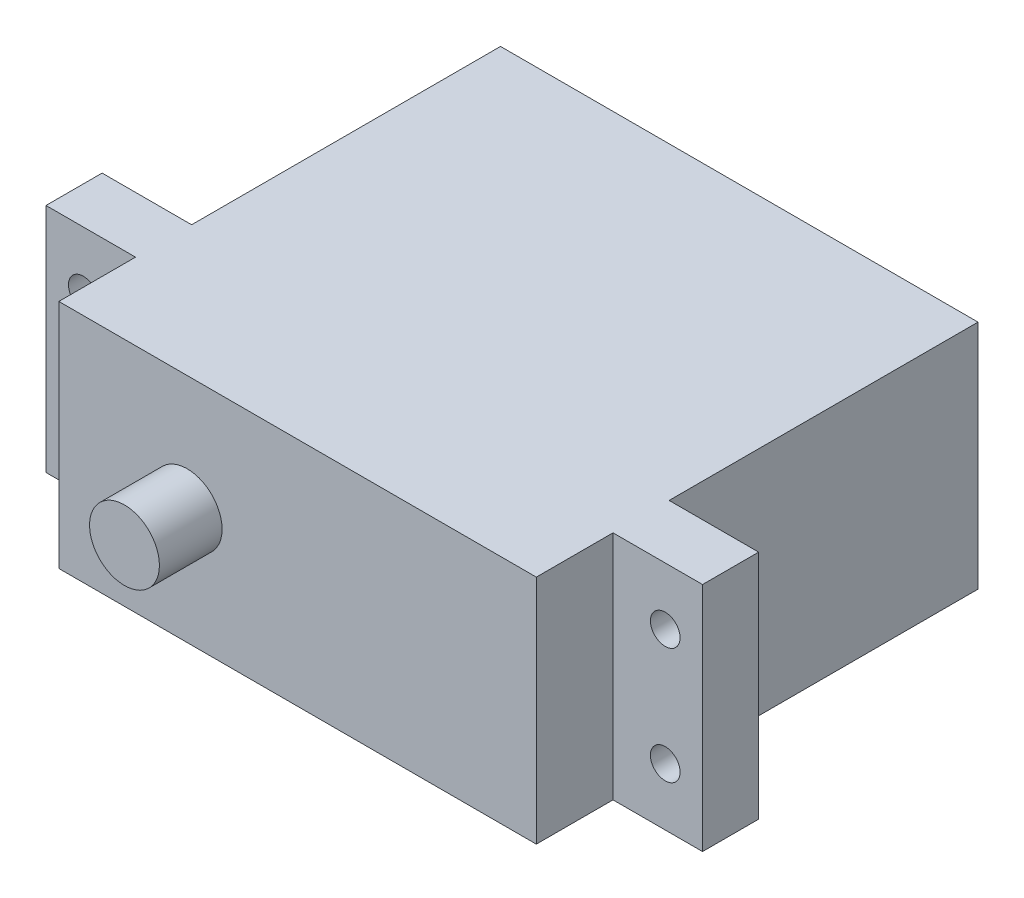
ISO-10303-21;
HEADER;
FILE_DESCRIPTION(('STEP AP214'),'2;1');
FILE_NAME('part.step','',(''),(''),'','','');
FILE_SCHEMA(('AUTOMOTIVE_DESIGN { 1 0 10303 214 1 1 1 1 }'));
ENDSEC;
DATA;
#1=APPLICATION_CONTEXT('core data for automotive mechanical design processes');
#2=APPLICATION_PROTOCOL_DEFINITION('international standard','automotive_design',2000,#1);
#3=PRODUCT_CONTEXT('',#1,'mechanical');
#4=PRODUCT('Part','Part','',(#3));
#5=PRODUCT_RELATED_PRODUCT_CATEGORY('part','',(#4));
#6=PRODUCT_DEFINITION_FORMATION('','',#4);
#7=PRODUCT_DEFINITION_CONTEXT('part definition',#1,'design');
#8=PRODUCT_DEFINITION('design','',#6,#7);
#9=PRODUCT_DEFINITION_SHAPE('','',#8);
#10=(LENGTH_UNIT() NAMED_UNIT(*) SI_UNIT(.MILLI.,.METRE.));
#11=(NAMED_UNIT(*) PLANE_ANGLE_UNIT() SI_UNIT($,.RADIAN.));
#12=(NAMED_UNIT(*) SI_UNIT($,.STERADIAN.) SOLID_ANGLE_UNIT());
#13=UNCERTAINTY_MEASURE_WITH_UNIT(LENGTH_MEASURE(1.E-05),#10,'distance_accuracy_value','');
#14=(GEOMETRIC_REPRESENTATION_CONTEXT(3) GLOBAL_UNCERTAINTY_ASSIGNED_CONTEXT((#13)) GLOBAL_UNIT_ASSIGNED_CONTEXT((#10,
#11,#12)) REPRESENTATION_CONTEXT('',''));
#15=CARTESIAN_POINT('',(0.,0.,0.));
#16=DIRECTION('',(0.,0.,1.));
#17=DIRECTION('',(1.,0.,0.));
#18=AXIS2_PLACEMENT_3D('',#15,#16,#17);
#19=CARTESIAN_POINT('',(-27.94,-9.8425,42.926));
#20=DIRECTION('',(1.,0.,0.));
#21=DIRECTION('',(0.,0.,-1.));
#22=AXIS2_PLACEMENT_3D('',#19,#20,#21);
#23=PLANE('',#22);
#24=DIRECTION('',(0.,0.,-1.));
#25=VECTOR('',#24,1.);
#26=CARTESIAN_POINT('',(-27.94,-9.8425,42.926));
#27=LINE('',#26,#25);
#28=CARTESIAN_POINT('',(-27.94,-9.8425,31.0642));
#29=VERTEX_POINT('',#28);
#30=CARTESIAN_POINT('',(-27.94,-9.8425,26.289));
#31=VERTEX_POINT('',#30);
#32=EDGE_CURVE('E42',#29,#31,#27,.T.);
#33=ORIENTED_EDGE('',*,*,#32,.F.);
#34=DIRECTION('',(0.,-1.,0.));
#35=VECTOR('',#34,1.);
#36=CARTESIAN_POINT('',(-27.94,-9.8425,31.0642));
#37=LINE('',#36,#35);
#38=CARTESIAN_POINT('',(-27.94,9.8425,31.0642));
#39=VERTEX_POINT('',#38);
#40=EDGE_CURVE('E153',#39,#29,#37,.T.);
#41=ORIENTED_EDGE('',*,*,#40,.F.);
#42=DIRECTION('',(0.,0.,-1.));
#43=VECTOR('',#42,1.);
#44=CARTESIAN_POINT('',(-27.94,9.8425,42.926));
#45=LINE('',#44,#43);
#46=CARTESIAN_POINT('',(-27.94,9.8425,26.289));
#47=VERTEX_POINT('',#46);
#48=EDGE_CURVE('E232',#39,#47,#45,.T.);
#49=ORIENTED_EDGE('',*,*,#48,.T.);
#50=DIRECTION('',(0.,1.,0.));
#51=VECTOR('',#50,1.);
#52=CARTESIAN_POINT('',(-27.94,9.8425,26.289));
#53=LINE('',#52,#51);
#54=EDGE_CURVE('E180',#31,#47,#53,.T.);
#55=ORIENTED_EDGE('',*,*,#54,.F.);
#56=EDGE_LOOP('',(#33,#41,#49,#55));
#57=FACE_BOUND('',#56,.T.);
#58=ADVANCED_FACE('F34',(#57),#23,.F.);
#59=CARTESIAN_POINT('',(-27.94,-9.8425,42.926));
#60=DIRECTION('',(0.,1.,0.));
#61=DIRECTION('',(0.,0.,1.));
#62=AXIS2_PLACEMENT_3D('',#59,#60,#61);
#63=PLANE('',#62);
#64=DIRECTION('',(1.,0.,0.));
#65=VECTOR('',#64,1.);
#66=CARTESIAN_POINT('',(27.94,-9.8425,31.0642));
#67=LINE('',#66,#65);
#68=CARTESIAN_POINT('',(20.32,-9.8425,31.0642));
#69=VERTEX_POINT('',#68);
#70=CARTESIAN_POINT('',(27.94,-9.8425,31.0642));
#71=VERTEX_POINT('',#70);
#72=EDGE_CURVE('E129',#69,#71,#67,.T.);
#73=ORIENTED_EDGE('',*,*,#72,.F.);
#74=DIRECTION('',(0.,0.,1.));
#75=VECTOR('',#74,1.);
#76=CARTESIAN_POINT('',(20.32,-9.8425,31.0642));
#77=LINE('',#76,#75);
#78=CARTESIAN_POINT('',(20.32,-9.8425,37.592));
#79=VERTEX_POINT('',#78);
#80=EDGE_CURVE('E126',#69,#79,#77,.T.);
#81=ORIENTED_EDGE('',*,*,#80,.T.);
#82=DIRECTION('',(1.,0.,0.));
#83=VECTOR('',#82,1.);
#84=CARTESIAN_POINT('',(-27.94,-9.8425,37.592));
#85=LINE('',#84,#83);
#86=CARTESIAN_POINT('',(-20.32,-9.8425,37.592));
#87=VERTEX_POINT('',#86);
#88=EDGE_CURVE('E222',#87,#79,#85,.T.);
#89=ORIENTED_EDGE('',*,*,#88,.F.);
#90=DIRECTION('',(0.,0.,1.));
#91=VECTOR('',#90,1.);
#92=CARTESIAN_POINT('',(-20.32,-9.8425,31.0642));
#93=LINE('',#92,#91);
#94=CARTESIAN_POINT('',(-20.32,-9.8425,31.0642));
#95=VERTEX_POINT('',#94);
#96=EDGE_CURVE('E58',#95,#87,#93,.T.);
#97=ORIENTED_EDGE('',*,*,#96,.F.);
#98=DIRECTION('',(1.,0.,0.));
#99=VECTOR('',#98,1.);
#100=CARTESIAN_POINT('',(-20.32,-9.8425,31.0642));
#101=LINE('',#100,#99);
#102=EDGE_CURVE('E155',#29,#95,#101,.T.);
#103=ORIENTED_EDGE('',*,*,#102,.F.);
#104=ORIENTED_EDGE('',*,*,#32,.T.);
#105=DIRECTION('',(-1.,0.,0.));
#106=VECTOR('',#105,1.);
#107=CARTESIAN_POINT('',(-27.94,-9.8425,26.289));
#108=LINE('',#107,#106);
#109=CARTESIAN_POINT('',(-20.32,-9.8425,26.289));
#110=VERTEX_POINT('',#109);
#111=EDGE_CURVE('E189',#110,#31,#108,.T.);
#112=ORIENTED_EDGE('',*,*,#111,.F.);
#113=DIRECTION('',(0.,0.,-1.));
#114=VECTOR('',#113,1.);
#115=CARTESIAN_POINT('',(-20.32,-9.8425,26.289));
#116=LINE('',#115,#114);
#117=CARTESIAN_POINT('',(-20.32,-9.8425,0.));
#118=VERTEX_POINT('',#117);
#119=EDGE_CURVE('E194',#110,#118,#116,.T.);
#120=ORIENTED_EDGE('',*,*,#119,.T.);
#121=DIRECTION('',(1.,0.,0.));
#122=VECTOR('',#121,1.);
#123=CARTESIAN_POINT('',(-27.94,-9.8425,0.));
#124=LINE('',#123,#122);
#125=CARTESIAN_POINT('',(20.32,-9.8425,0.));
#126=VERTEX_POINT('',#125);
#127=EDGE_CURVE('E227',#118,#126,#124,.T.);
#128=ORIENTED_EDGE('',*,*,#127,.T.);
#129=DIRECTION('',(0.,0.,-1.));
#130=VECTOR('',#129,1.);
#131=CARTESIAN_POINT('',(20.32,-9.8425,26.289));
#132=LINE('',#131,#130);
#133=CARTESIAN_POINT('',(20.32,-9.8425,26.289));
#134=VERTEX_POINT('',#133);
#135=EDGE_CURVE('E211',#134,#126,#132,.T.);
#136=ORIENTED_EDGE('',*,*,#135,.F.);
#137=DIRECTION('',(-1.,0.,0.));
#138=VECTOR('',#137,1.);
#139=CARTESIAN_POINT('',(20.32,-9.8425,26.289));
#140=LINE('',#139,#138);
#141=CARTESIAN_POINT('',(27.94,-9.8425,26.289));
#142=VERTEX_POINT('',#141);
#143=EDGE_CURVE('E199',#142,#134,#140,.T.);
#144=ORIENTED_EDGE('',*,*,#143,.F.);
#145=DIRECTION('',(0.,0.,-1.));
#146=VECTOR('',#145,1.);
#147=CARTESIAN_POINT('',(27.94,-9.8425,42.926));
#148=LINE('',#147,#146);
#149=EDGE_CURVE('E236',#71,#142,#148,.T.);
#150=ORIENTED_EDGE('',*,*,#149,.F.);
#151=EDGE_LOOP('',(#73,#81,#89,#97,#103,#104,#112,#120,#128,#136,#144,#150));
#152=FACE_BOUND('',#151,.T.);
#153=ADVANCED_FACE('F289',(#152),#63,.F.);
#154=CARTESIAN_POINT('',(27.94,-9.8425,42.926));
#155=DIRECTION('',(-1.,0.,0.));
#156=DIRECTION('',(0.,-1.,0.));
#157=AXIS2_PLACEMENT_3D('',#154,#155,#156);
#158=PLANE('',#157);
#159=DIRECTION('',(0.,0.,-1.));
#160=VECTOR('',#159,1.);
#161=CARTESIAN_POINT('',(27.94,9.8425,42.926));
#162=LINE('',#161,#160);
#163=CARTESIAN_POINT('',(27.94,9.8425,31.0642));
#164=VERTEX_POINT('',#163);
#165=CARTESIAN_POINT('',(27.94,9.8425,26.289));
#166=VERTEX_POINT('',#165);
#167=EDGE_CURVE('E234',#164,#166,#162,.T.);
#168=ORIENTED_EDGE('',*,*,#167,.F.);
#169=DIRECTION('',(0.,1.,0.));
#170=VECTOR('',#169,1.);
#171=CARTESIAN_POINT('',(27.94,9.8425,31.0642));
#172=LINE('',#171,#170);
#173=EDGE_CURVE('E136',#71,#164,#172,.T.);
#174=ORIENTED_EDGE('',*,*,#173,.F.);
#175=ORIENTED_EDGE('',*,*,#149,.T.);
#176=DIRECTION('',(0.,-1.,0.));
#177=VECTOR('',#176,1.);
#178=CARTESIAN_POINT('',(27.94,-9.8425,26.289));
#179=LINE('',#178,#177);
#180=EDGE_CURVE('E208',#166,#142,#179,.T.);
#181=ORIENTED_EDGE('',*,*,#180,.F.);
#182=EDGE_LOOP('',(#168,#174,#175,#181));
#183=FACE_BOUND('',#182,.T.);
#184=ADVANCED_FACE('F299',(#183),#158,.F.);
#185=CARTESIAN_POINT('',(-27.94,9.8425,42.926));
#186=DIRECTION('',(0.,-1.,0.));
#187=DIRECTION('',(0.,0.,-1.));
#188=AXIS2_PLACEMENT_3D('',#185,#186,#187);
#189=PLANE('',#188);
#190=DIRECTION('',(-1.,0.,0.));
#191=VECTOR('',#190,1.);
#192=CARTESIAN_POINT('',(-27.94,9.8425,37.592));
#193=LINE('',#192,#191);
#194=CARTESIAN_POINT('',(20.32,9.8425,37.592));
#195=VERTEX_POINT('',#194);
#196=CARTESIAN_POINT('',(-20.32,9.8425,37.592));
#197=VERTEX_POINT('',#196);
#198=EDGE_CURVE('E12',#195,#197,#193,.T.);
#199=ORIENTED_EDGE('',*,*,#198,.F.);
#200=DIRECTION('',(0.,0.,1.));
#201=VECTOR('',#200,1.);
#202=CARTESIAN_POINT('',(20.32,9.8425,31.0642));
#203=LINE('',#202,#201);
#204=CARTESIAN_POINT('',(20.32,9.8425,31.0642));
#205=VERTEX_POINT('',#204);
#206=EDGE_CURVE('E50',#205,#195,#203,.T.);
#207=ORIENTED_EDGE('',*,*,#206,.F.);
#208=DIRECTION('',(-1.,0.,0.));
#209=VECTOR('',#208,1.);
#210=CARTESIAN_POINT('',(20.32,9.8425,31.0642));
#211=LINE('',#210,#209);
#212=EDGE_CURVE('E130',#164,#205,#211,.T.);
#213=ORIENTED_EDGE('',*,*,#212,.F.);
#214=ORIENTED_EDGE('',*,*,#167,.T.);
#215=DIRECTION('',(1.,0.,0.));
#216=VECTOR('',#215,1.);
#217=CARTESIAN_POINT('',(27.94,9.8425,26.289));
#218=LINE('',#217,#216);
#219=CARTESIAN_POINT('',(20.32,9.8425,26.289));
#220=VERTEX_POINT('',#219);
#221=EDGE_CURVE('E205',#220,#166,#218,.T.);
#222=ORIENTED_EDGE('',*,*,#221,.F.);
#223=DIRECTION('',(0.,0.,-1.));
#224=VECTOR('',#223,1.);
#225=CARTESIAN_POINT('',(20.32,9.8425,26.289));
#226=LINE('',#225,#224);
#227=CARTESIAN_POINT('',(20.32,9.8425,0.));
#228=VERTEX_POINT('',#227);
#229=EDGE_CURVE('E213',#220,#228,#226,.T.);
#230=ORIENTED_EDGE('',*,*,#229,.T.);
#231=DIRECTION('',(-1.,0.,0.));
#232=VECTOR('',#231,1.);
#233=CARTESIAN_POINT('',(-27.94,9.8425,0.));
#234=LINE('',#233,#232);
#235=CARTESIAN_POINT('',(-20.32,9.8425,0.));
#236=VERTEX_POINT('',#235);
#237=EDGE_CURVE('E229',#228,#236,#234,.T.);
#238=ORIENTED_EDGE('',*,*,#237,.T.);
#239=DIRECTION('',(0.,0.,-1.));
#240=VECTOR('',#239,1.);
#241=CARTESIAN_POINT('',(-20.32,9.8425,26.289));
#242=LINE('',#241,#240);
#243=CARTESIAN_POINT('',(-20.32,9.8425,26.289));
#244=VERTEX_POINT('',#243);
#245=EDGE_CURVE('E192',#244,#236,#242,.T.);
#246=ORIENTED_EDGE('',*,*,#245,.F.);
#247=DIRECTION('',(1.,0.,0.));
#248=VECTOR('',#247,1.);
#249=CARTESIAN_POINT('',(-20.32,9.8425,26.289));
#250=LINE('',#249,#248);
#251=EDGE_CURVE('E183',#47,#244,#250,.T.);
#252=ORIENTED_EDGE('',*,*,#251,.F.);
#253=ORIENTED_EDGE('',*,*,#48,.F.);
#254=DIRECTION('',(-1.,0.,0.));
#255=VECTOR('',#254,1.);
#256=CARTESIAN_POINT('',(-27.94,9.8425,31.0642));
#257=LINE('',#256,#255);
#258=CARTESIAN_POINT('',(-20.32,9.8425,31.0642));
#259=VERTEX_POINT('',#258);
#260=EDGE_CURVE('E161',#259,#39,#257,.T.);
#261=ORIENTED_EDGE('',*,*,#260,.F.);
#262=DIRECTION('',(0.,0.,1.));
#263=VECTOR('',#262,1.);
#264=CARTESIAN_POINT('',(-20.32,9.8425,31.0642));
#265=LINE('',#264,#263);
#266=EDGE_CURVE('E164',#259,#197,#265,.T.);
#267=ORIENTED_EDGE('',*,*,#266,.T.);
#268=EDGE_LOOP('',(#199,#207,#213,#214,#222,#230,#238,#246,#252,#253,#261,#267));
#269=FACE_BOUND('',#268,.T.);
#270=ADVANCED_FACE('F142',(#269),#189,.F.);
#271=CARTESIAN_POINT('',(-27.94,9.8425,0.));
#272=DIRECTION('',(0.,0.,-1.));
#273=DIRECTION('',(-1.,0.,0.));
#274=AXIS2_PLACEMENT_3D('',#271,#272,#273);
#275=PLANE('',#274);
#276=DIRECTION('',(0.,-1.,0.));
#277=VECTOR('',#276,1.);
#278=CARTESIAN_POINT('',(-20.32,-9.8425,0.));
#279=LINE('',#278,#277);
#280=EDGE_CURVE('E179',#236,#118,#279,.T.);
#281=ORIENTED_EDGE('',*,*,#280,.F.);
#282=ORIENTED_EDGE('',*,*,#237,.F.);
#283=DIRECTION('',(0.,1.,0.));
#284=VECTOR('',#283,1.);
#285=CARTESIAN_POINT('',(20.32,9.8425,0.));
#286=LINE('',#285,#284);
#287=EDGE_CURVE('E197',#126,#228,#286,.T.);
#288=ORIENTED_EDGE('',*,*,#287,.F.);
#289=ORIENTED_EDGE('',*,*,#127,.F.);
#290=EDGE_LOOP('',(#281,#282,#288,#289));
#291=FACE_BOUND('',#290,.T.);
#292=ADVANCED_FACE('F285',(#291),#275,.T.);
#293=CARTESIAN_POINT('',(0.,0.,37.592));
#294=DIRECTION('',(0.,0.,1.));
#295=DIRECTION('',(1.,0.,0.));
#296=AXIS2_PLACEMENT_3D('',#293,#294,#295);
#297=PLANE('',#296);
#298=DIRECTION('',(0.,-1.,0.));
#299=VECTOR('',#298,1.);
#300=CARTESIAN_POINT('',(20.32,-9.8425,37.592));
#301=LINE('',#300,#299);
#302=EDGE_CURVE('E139',#195,#79,#301,.T.);
#303=ORIENTED_EDGE('',*,*,#302,.F.);
#304=ORIENTED_EDGE('',*,*,#198,.T.);
#305=DIRECTION('',(0.,1.,0.));
#306=VECTOR('',#305,1.);
#307=CARTESIAN_POINT('',(-20.32,9.8425,37.592));
#308=LINE('',#307,#306);
#309=EDGE_CURVE('E152',#87,#197,#308,.T.);
#310=ORIENTED_EDGE('',*,*,#309,.F.);
#311=ORIENTED_EDGE('',*,*,#88,.T.);
#312=EDGE_LOOP('',(#303,#304,#310,#311));
#313=FACE_BOUND('',#312,.T.);
#314=CARTESIAN_POINT('',(-9.39800000000001,0.,37.592));
#315=DIRECTION('',(0.,0.,1.));
#316=DIRECTION('',(1.,0.,0.));
#317=AXIS2_PLACEMENT_3D('',#314,#315,#316);
#318=CIRCLE('',#317,2.9718);
#319=CARTESIAN_POINT('',(-6.42620000000001,0.,37.592));
#320=VERTEX_POINT('',#319);
#321=EDGE_CURVE('E219',#320,#320,#318,.T.);
#322=ORIENTED_EDGE('',*,*,#321,.F.);
#323=EDGE_LOOP('',(#322));
#324=FACE_BOUND('',#323,.T.);
#325=ADVANCED_FACE('F312',(#313,#324),#297,.T.);
#326=CARTESIAN_POINT('',(-9.39800000000001,0.,37.592));
#327=DIRECTION('',(0.,0.,1.));
#328=DIRECTION('',(1.,0.,0.));
#329=AXIS2_PLACEMENT_3D('',#326,#327,#328);
#330=CYLINDRICAL_SURFACE('',#329,2.9718);
#331=ORIENTED_EDGE('',*,*,#321,.T.);
#332=EDGE_LOOP('',(#331));
#333=FACE_BOUND('',#332,.T.);
#334=CARTESIAN_POINT('',(-9.39800000000001,0.,42.926));
#335=DIRECTION('',(0.,0.,1.));
#336=DIRECTION('',(1.,0.,0.));
#337=AXIS2_PLACEMENT_3D('',#334,#335,#336);
#338=CIRCLE('',#337,2.9718);
#339=CARTESIAN_POINT('',(-6.42620000000001,0.,42.926));
#340=VERTEX_POINT('',#339);
#341=EDGE_CURVE('E216',#340,#340,#338,.T.);
#342=ORIENTED_EDGE('',*,*,#341,.F.);
#343=EDGE_LOOP('',(#342));
#344=FACE_BOUND('',#343,.T.);
#345=ADVANCED_FACE('F316',(#333,#344),#330,.T.);
#346=CARTESIAN_POINT('',(-27.94,9.8425,42.926));
#347=DIRECTION('',(0.,0.,-1.));
#348=DIRECTION('',(-1.,0.,0.));
#349=AXIS2_PLACEMENT_3D('',#346,#347,#348);
#350=PLANE('',#349);
#351=ORIENTED_EDGE('',*,*,#341,.T.);
#352=EDGE_LOOP('',(#351));
#353=FACE_BOUND('',#352,.T.);
#354=ADVANCED_FACE('F322',(#353),#350,.F.);
#355=CARTESIAN_POINT('',(20.32,9.8425,26.289));
#356=DIRECTION('',(-1.,0.,0.));
#357=DIRECTION('',(0.,0.,1.));
#358=AXIS2_PLACEMENT_3D('',#355,#356,#357);
#359=PLANE('',#358);
#360=ORIENTED_EDGE('',*,*,#287,.T.);
#361=ORIENTED_EDGE('',*,*,#229,.F.);
#362=DIRECTION('',(0.,1.,0.));
#363=VECTOR('',#362,1.);
#364=CARTESIAN_POINT('',(20.32,9.8425,26.289));
#365=LINE('',#364,#363);
#366=EDGE_CURVE('E202',#134,#220,#365,.T.);
#367=ORIENTED_EDGE('',*,*,#366,.F.);
#368=ORIENTED_EDGE('',*,*,#135,.T.);
#369=EDGE_LOOP('',(#360,#361,#367,#368));
#370=FACE_BOUND('',#369,.T.);
#371=ADVANCED_FACE('F292',(#370),#359,.F.);
#372=CARTESIAN_POINT('',(27.94,-9.8425,26.289));
#373=DIRECTION('',(0.,0.,1.));
#374=DIRECTION('',(1.,0.,0.));
#375=AXIS2_PLACEMENT_3D('',#372,#373,#374);
#376=PLANE('',#375);
#377=CARTESIAN_POINT('',(24.765,4.953,26.289));
#378=DIRECTION('',(0.,0.,1.));
#379=DIRECTION('',(1.,0.,0.));
#380=AXIS2_PLACEMENT_3D('',#377,#378,#379);
#381=CIRCLE('',#380,1.26364999999999);
#382=CARTESIAN_POINT('',(26.02865,4.953,26.289));
#383=VERTEX_POINT('',#382);
#384=EDGE_CURVE('E175',#383,#383,#381,.T.);
#385=ORIENTED_EDGE('',*,*,#384,.T.);
#386=EDGE_LOOP('',(#385));
#387=FACE_BOUND('',#386,.T.);
#388=CARTESIAN_POINT('',(24.765,-4.953,26.289));
#389=DIRECTION('',(0.,0.,1.));
#390=DIRECTION('',(1.,0.,0.));
#391=AXIS2_PLACEMENT_3D('',#388,#389,#390);
#392=CIRCLE('',#391,1.26364999999999);
#393=CARTESIAN_POINT('',(26.02865,-4.953,26.289));
#394=VERTEX_POINT('',#393);
#395=EDGE_CURVE('E176',#394,#394,#392,.T.);
#396=ORIENTED_EDGE('',*,*,#395,.T.);
#397=EDGE_LOOP('',(#396));
#398=FACE_BOUND('',#397,.T.);
#399=ORIENTED_EDGE('',*,*,#143,.T.);
#400=ORIENTED_EDGE('',*,*,#366,.T.);
#401=ORIENTED_EDGE('',*,*,#221,.T.);
#402=ORIENTED_EDGE('',*,*,#180,.T.);
#403=EDGE_LOOP('',(#399,#400,#401,#402));
#404=FACE_BOUND('',#403,.T.);
#405=ADVANCED_FACE('F295',(#387,#398,#404),#376,.F.);
#406=CARTESIAN_POINT('',(-20.32,-9.8425,26.289));
#407=DIRECTION('',(1.,0.,0.));
#408=DIRECTION('',(0.,1.,0.));
#409=AXIS2_PLACEMENT_3D('',#406,#407,#408);
#410=PLANE('',#409);
#411=ORIENTED_EDGE('',*,*,#280,.T.);
#412=ORIENTED_EDGE('',*,*,#119,.F.);
#413=DIRECTION('',(0.,-1.,0.));
#414=VECTOR('',#413,1.);
#415=CARTESIAN_POINT('',(-20.32,-9.8425,26.289));
#416=LINE('',#415,#414);
#417=EDGE_CURVE('E186',#244,#110,#416,.T.);
#418=ORIENTED_EDGE('',*,*,#417,.F.);
#419=ORIENTED_EDGE('',*,*,#245,.T.);
#420=EDGE_LOOP('',(#411,#412,#418,#419));
#421=FACE_BOUND('',#420,.T.);
#422=ADVANCED_FACE('F269',(#421),#410,.F.);
#423=CARTESIAN_POINT('',(-27.94,-9.8425,26.289));
#424=DIRECTION('',(0.,0.,1.));
#425=DIRECTION('',(1.,0.,0.));
#426=AXIS2_PLACEMENT_3D('',#423,#424,#425);
#427=PLANE('',#426);
#428=CARTESIAN_POINT('',(-24.765,4.953,26.289));
#429=DIRECTION('',(0.,0.,1.));
#430=DIRECTION('',(1.,0.,0.));
#431=AXIS2_PLACEMENT_3D('',#428,#429,#430);
#432=CIRCLE('',#431,1.26364999999999);
#433=CARTESIAN_POINT('',(-23.50135,4.953,26.289));
#434=VERTEX_POINT('',#433);
#435=EDGE_CURVE('E171',#434,#434,#432,.T.);
#436=ORIENTED_EDGE('',*,*,#435,.T.);
#437=EDGE_LOOP('',(#436));
#438=FACE_BOUND('',#437,.T.);
#439=CARTESIAN_POINT('',(-24.765,-4.953,26.289));
#440=DIRECTION('',(0.,0.,1.));
#441=DIRECTION('',(1.,0.,0.));
#442=AXIS2_PLACEMENT_3D('',#439,#440,#441);
#443=CIRCLE('',#442,1.26364999999999);
#444=CARTESIAN_POINT('',(-23.50135,-4.953,26.289));
#445=VERTEX_POINT('',#444);
#446=EDGE_CURVE('E172',#445,#445,#443,.T.);
#447=ORIENTED_EDGE('',*,*,#446,.T.);
#448=EDGE_LOOP('',(#447));
#449=FACE_BOUND('',#448,.T.);
#450=ORIENTED_EDGE('',*,*,#54,.T.);
#451=ORIENTED_EDGE('',*,*,#251,.T.);
#452=ORIENTED_EDGE('',*,*,#417,.T.);
#453=ORIENTED_EDGE('',*,*,#111,.T.);
#454=EDGE_LOOP('',(#450,#451,#452,#453));
#455=FACE_BOUND('',#454,.T.);
#456=ADVANCED_FACE('F265',(#438,#449,#455),#427,.F.);
#457=CARTESIAN_POINT('',(24.765,-4.953,37.592));
#458=DIRECTION('',(0.,0.,1.));
#459=DIRECTION('',(1.,0.,0.));
#460=AXIS2_PLACEMENT_3D('',#457,#458,#459);
#461=CYLINDRICAL_SURFACE('',#460,1.26364999999999);
#462=CARTESIAN_POINT('',(24.765,-4.953,31.0642));
#463=DIRECTION('',(0.,0.,-1.));
#464=DIRECTION('',(-1.,0.,0.));
#465=AXIS2_PLACEMENT_3D('',#462,#463,#464);
#466=CIRCLE('',#465,1.26364999999999);
#467=CARTESIAN_POINT('',(23.50135,-4.953,31.0642));
#468=VERTEX_POINT('',#467);
#469=EDGE_CURVE('E149',#468,#468,#466,.F.);
#470=ORIENTED_EDGE('',*,*,#469,.T.);
#471=EDGE_LOOP('',(#470));
#472=FACE_BOUND('',#471,.T.);
#473=ORIENTED_EDGE('',*,*,#395,.F.);
#474=EDGE_LOOP('',(#473));
#475=FACE_BOUND('',#474,.T.);
#476=ADVANCED_FACE('F268',(#472,#475),#461,.F.);
#477=CARTESIAN_POINT('',(24.765,4.953,37.592));
#478=DIRECTION('',(0.,0.,1.));
#479=DIRECTION('',(1.,0.,0.));
#480=AXIS2_PLACEMENT_3D('',#477,#478,#479);
#481=CYLINDRICAL_SURFACE('',#480,1.26364999999999);
#482=CARTESIAN_POINT('',(24.765,4.953,31.0642));
#483=DIRECTION('',(0.,0.,-1.));
#484=DIRECTION('',(-1.,0.,0.));
#485=AXIS2_PLACEMENT_3D('',#482,#483,#484);
#486=CIRCLE('',#485,1.26364999999999);
#487=CARTESIAN_POINT('',(23.50135,4.953,31.0642));
#488=VERTEX_POINT('',#487);
#489=EDGE_CURVE('E37',#488,#488,#486,.F.);
#490=ORIENTED_EDGE('',*,*,#489,.T.);
#491=EDGE_LOOP('',(#490));
#492=FACE_BOUND('',#491,.T.);
#493=ORIENTED_EDGE('',*,*,#384,.F.);
#494=EDGE_LOOP('',(#493));
#495=FACE_BOUND('',#494,.T.);
#496=ADVANCED_FACE('F261',(#492,#495),#481,.F.);
#497=CARTESIAN_POINT('',(-24.765,-4.953,37.592));
#498=DIRECTION('',(0.,0.,1.));
#499=DIRECTION('',(1.,0.,0.));
#500=AXIS2_PLACEMENT_3D('',#497,#498,#499);
#501=CYLINDRICAL_SURFACE('',#500,1.26364999999999);
#502=CARTESIAN_POINT('',(-24.765,-4.953,31.0642));
#503=DIRECTION('',(0.,0.,-1.));
#504=DIRECTION('',(-1.,0.,0.));
#505=AXIS2_PLACEMENT_3D('',#502,#503,#504);
#506=CIRCLE('',#505,1.26364999999999);
#507=CARTESIAN_POINT('',(-26.02865,-4.953,31.0642));
#508=VERTEX_POINT('',#507);
#509=EDGE_CURVE('E168',#508,#508,#506,.F.);
#510=ORIENTED_EDGE('',*,*,#509,.T.);
#511=EDGE_LOOP('',(#510));
#512=FACE_BOUND('',#511,.T.);
#513=ORIENTED_EDGE('',*,*,#446,.F.);
#514=EDGE_LOOP('',(#513));
#515=FACE_BOUND('',#514,.T.);
#516=ADVANCED_FACE('F258',(#512,#515),#501,.F.);
#517=CARTESIAN_POINT('',(-24.765,4.953,37.592));
#518=DIRECTION('',(0.,0.,1.));
#519=DIRECTION('',(1.,0.,0.));
#520=AXIS2_PLACEMENT_3D('',#517,#518,#519);
#521=CYLINDRICAL_SURFACE('',#520,1.26364999999999);
#522=CARTESIAN_POINT('',(-24.765,4.953,31.0642));
#523=DIRECTION('',(0.,0.,-1.));
#524=DIRECTION('',(-1.,0.,0.));
#525=AXIS2_PLACEMENT_3D('',#522,#523,#524);
#526=CIRCLE('',#525,1.26364999999999);
#527=CARTESIAN_POINT('',(-26.02865,4.953,31.0642));
#528=VERTEX_POINT('',#527);
#529=EDGE_CURVE('E166',#528,#528,#526,.F.);
#530=ORIENTED_EDGE('',*,*,#529,.T.);
#531=EDGE_LOOP('',(#530));
#532=FACE_BOUND('',#531,.T.);
#533=ORIENTED_EDGE('',*,*,#435,.F.);
#534=EDGE_LOOP('',(#533));
#535=FACE_BOUND('',#534,.T.);
#536=ADVANCED_FACE('F245',(#532,#535),#521,.F.);
#537=CARTESIAN_POINT('',(-27.94,9.8425,31.0642));
#538=DIRECTION('',(0.,0.,-1.));
#539=DIRECTION('',(-1.,0.,0.));
#540=AXIS2_PLACEMENT_3D('',#537,#538,#539);
#541=PLANE('',#540);
#542=ORIENTED_EDGE('',*,*,#529,.F.);
#543=EDGE_LOOP('',(#542));
#544=FACE_BOUND('',#543,.T.);
#545=ORIENTED_EDGE('',*,*,#40,.T.);
#546=ORIENTED_EDGE('',*,*,#102,.T.);
#547=DIRECTION('',(0.,1.,0.));
#548=VECTOR('',#547,1.);
#549=CARTESIAN_POINT('',(-20.32,9.8425,31.0642));
#550=LINE('',#549,#548);
#551=EDGE_CURVE('E158',#95,#259,#550,.T.);
#552=ORIENTED_EDGE('',*,*,#551,.T.);
#553=ORIENTED_EDGE('',*,*,#260,.T.);
#554=EDGE_LOOP('',(#545,#546,#552,#553));
#555=FACE_BOUND('',#554,.T.);
#556=ORIENTED_EDGE('',*,*,#509,.F.);
#557=EDGE_LOOP('',(#556));
#558=FACE_BOUND('',#557,.T.);
#559=ADVANCED_FACE('F248',(#544,#555,#558),#541,.F.);
#560=CARTESIAN_POINT('',(-20.32,9.8425,31.0642));
#561=DIRECTION('',(1.,0.,0.));
#562=DIRECTION('',(0.,1.,0.));
#563=AXIS2_PLACEMENT_3D('',#560,#561,#562);
#564=PLANE('',#563);
#565=ORIENTED_EDGE('',*,*,#309,.T.);
#566=ORIENTED_EDGE('',*,*,#266,.F.);
#567=ORIENTED_EDGE('',*,*,#551,.F.);
#568=ORIENTED_EDGE('',*,*,#96,.T.);
#569=EDGE_LOOP('',(#565,#566,#567,#568));
#570=FACE_BOUND('',#569,.T.);
#571=ADVANCED_FACE('F251',(#570),#564,.F.);
#572=CARTESIAN_POINT('',(27.94,9.8425,31.0642));
#573=DIRECTION('',(0.,0.,-1.));
#574=DIRECTION('',(-1.,0.,0.));
#575=AXIS2_PLACEMENT_3D('',#572,#573,#574);
#576=PLANE('',#575);
#577=ORIENTED_EDGE('',*,*,#489,.F.);
#578=EDGE_LOOP('',(#577));
#579=FACE_BOUND('',#578,.T.);
#580=ORIENTED_EDGE('',*,*,#212,.T.);
#581=DIRECTION('',(0.,-1.,0.));
#582=VECTOR('',#581,1.);
#583=CARTESIAN_POINT('',(20.32,-9.8425,31.0642));
#584=LINE('',#583,#582);
#585=EDGE_CURVE('E122',#205,#69,#584,.T.);
#586=ORIENTED_EDGE('',*,*,#585,.T.);
#587=ORIENTED_EDGE('',*,*,#72,.T.);
#588=ORIENTED_EDGE('',*,*,#173,.T.);
#589=EDGE_LOOP('',(#580,#586,#587,#588));
#590=FACE_BOUND('',#589,.T.);
#591=ORIENTED_EDGE('',*,*,#469,.F.);
#592=EDGE_LOOP('',(#591));
#593=FACE_BOUND('',#592,.T.);
#594=ADVANCED_FACE('F133',(#579,#590,#593),#576,.F.);
#595=CARTESIAN_POINT('',(20.32,-9.8425,31.0642));
#596=DIRECTION('',(-1.,0.,0.));
#597=DIRECTION('',(0.,0.,1.));
#598=AXIS2_PLACEMENT_3D('',#595,#596,#597);
#599=PLANE('',#598);
#600=ORIENTED_EDGE('',*,*,#302,.T.);
#601=ORIENTED_EDGE('',*,*,#80,.F.);
#602=ORIENTED_EDGE('',*,*,#585,.F.);
#603=ORIENTED_EDGE('',*,*,#206,.T.);
#604=EDGE_LOOP('',(#600,#601,#602,#603));
#605=FACE_BOUND('',#604,.T.);
#606=ADVANCED_FACE('F124',(#605),#599,.F.);
#607=CLOSED_SHELL('',(#58,#153,#184,#270,#292,#325,#345,#354,#371,#405,#422,#456,#476,#496,#516,
#536,#559,#571,#594,#606));
#608=MANIFOLD_SOLID_BREP('B2',#607);
#609=ADVANCED_BREP_SHAPE_REPRESENTATION('',(#18,#608),#14);
#610=SHAPE_DEFINITION_REPRESENTATION(#9,#609);
ENDSEC;
END-ISO-10303-21;
